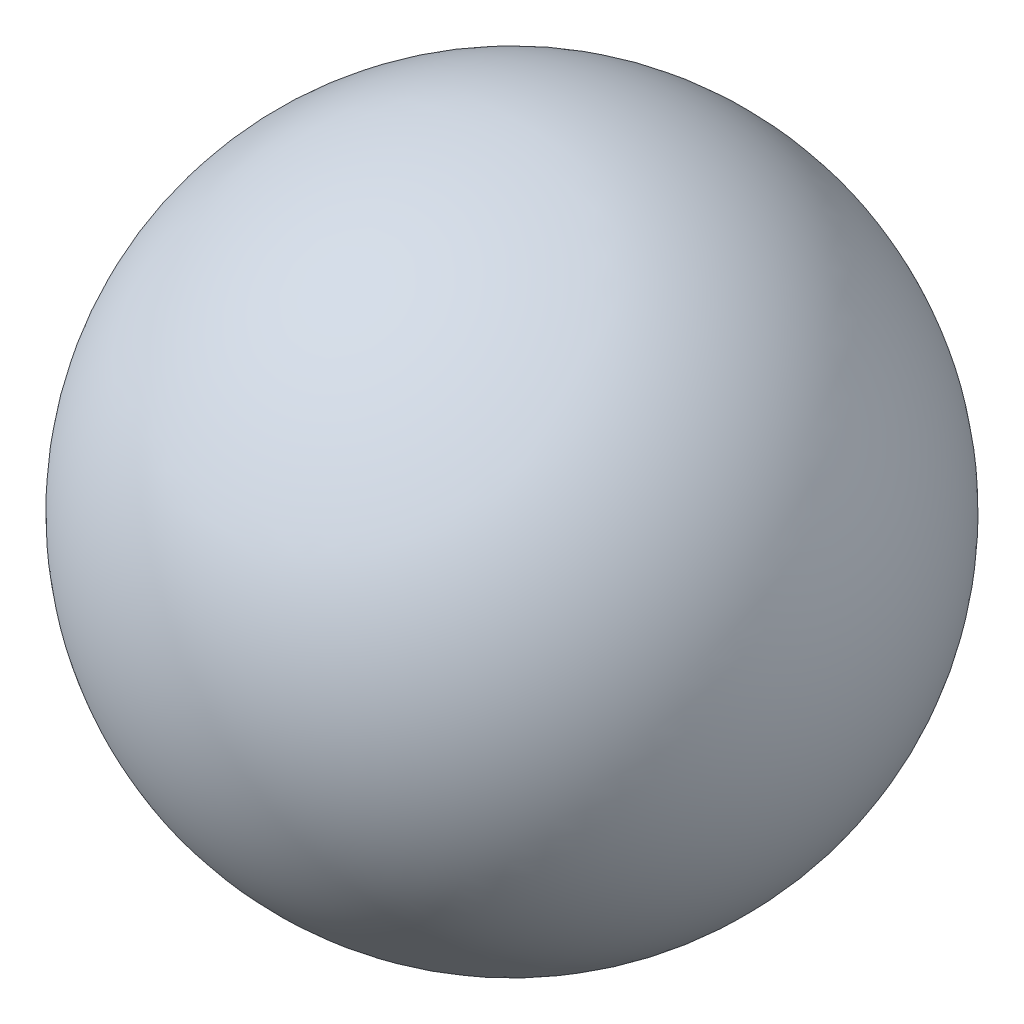
ISO-10303-21;
HEADER;
FILE_DESCRIPTION(('STEP AP214'),'2;1');
FILE_NAME('part.step','',(''),(''),'','','');
FILE_SCHEMA(('AUTOMOTIVE_DESIGN { 1 0 10303 214 1 1 1 1 }'));
ENDSEC;
DATA;
#1=APPLICATION_CONTEXT('core data for automotive mechanical design processes');
#2=APPLICATION_PROTOCOL_DEFINITION('international standard','automotive_design',2000,#1);
#3=PRODUCT_CONTEXT('',#1,'mechanical');
#4=PRODUCT('Part','Part','',(#3));
#5=PRODUCT_RELATED_PRODUCT_CATEGORY('part','',(#4));
#6=PRODUCT_DEFINITION_FORMATION('','',#4);
#7=PRODUCT_DEFINITION_CONTEXT('part definition',#1,'design');
#8=PRODUCT_DEFINITION('design','',#6,#7);
#9=PRODUCT_DEFINITION_SHAPE('','',#8);
#10=(LENGTH_UNIT() NAMED_UNIT(*) SI_UNIT(.MILLI.,.METRE.));
#11=(NAMED_UNIT(*) PLANE_ANGLE_UNIT() SI_UNIT($,.RADIAN.));
#12=(NAMED_UNIT(*) SI_UNIT($,.STERADIAN.) SOLID_ANGLE_UNIT());
#13=UNCERTAINTY_MEASURE_WITH_UNIT(LENGTH_MEASURE(1.E-05),#10,'distance_accuracy_value','');
#14=(GEOMETRIC_REPRESENTATION_CONTEXT(3) GLOBAL_UNCERTAINTY_ASSIGNED_CONTEXT((#13)) GLOBAL_UNIT_ASSIGNED_CONTEXT((#10,
#11,#12)) REPRESENTATION_CONTEXT('',''));
#15=CARTESIAN_POINT('',(0.,0.,0.));
#16=DIRECTION('',(0.,0.,1.));
#17=DIRECTION('',(1.,0.,0.));
#18=AXIS2_PLACEMENT_3D('',#15,#16,#17);
#19=CARTESIAN_POINT('',(0.,0.,0.));
#20=DIRECTION('',(0.,0.,-1.));
#21=DIRECTION('',(1.,0.,0.));
#22=AXIS2_PLACEMENT_3D('',#19,#20,#21);
#23=SPHERICAL_SURFACE('',#22,30.);
#24=CARTESIAN_POINT('',(0.,0.,-30.));
#25=VERTEX_POINT('',#24);
#26=VERTEX_LOOP('',#25);
#27=FACE_BOUND('',#26,.T.);
#28=ADVANCED_FACE('F37',(#27),#23,.T.);
#29=CLOSED_SHELL('',(#28));
#30=MANIFOLD_SOLID_BREP('B2',#29);
#31=ADVANCED_BREP_SHAPE_REPRESENTATION('',(#18,#30),#14);
#32=SHAPE_DEFINITION_REPRESENTATION(#9,#31);
ENDSEC;
END-ISO-10303-21;
